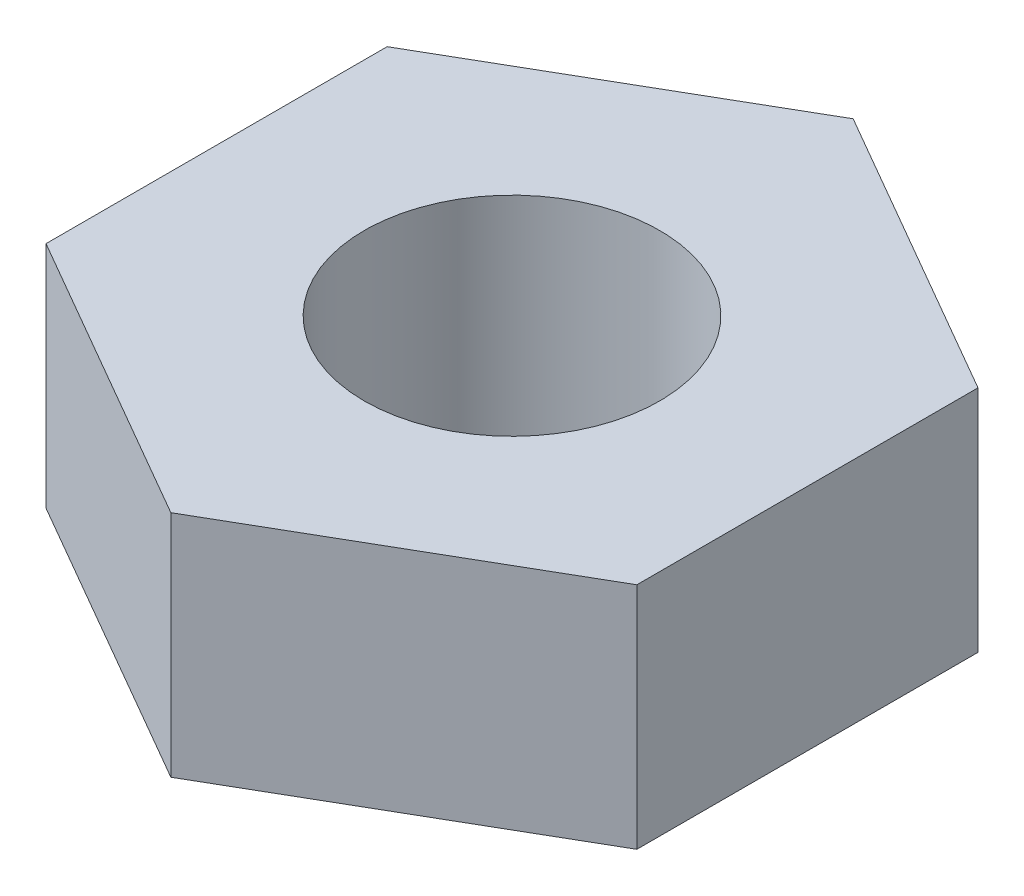
ISO-10303-21;
HEADER;
FILE_DESCRIPTION(('STEP AP214'),'2;1');
FILE_NAME('part.step','',(''),(''),'','','');
FILE_SCHEMA(('AUTOMOTIVE_DESIGN { 1 0 10303 214 1 1 1 1 }'));
ENDSEC;
DATA;
#1=APPLICATION_CONTEXT('core data for automotive mechanical design processes');
#2=APPLICATION_PROTOCOL_DEFINITION('international standard','automotive_design',2000,#1);
#3=PRODUCT_CONTEXT('',#1,'mechanical');
#4=PRODUCT('Part','Part','',(#3));
#5=PRODUCT_RELATED_PRODUCT_CATEGORY('part','',(#4));
#6=PRODUCT_DEFINITION_FORMATION('','',#4);
#7=PRODUCT_DEFINITION_CONTEXT('part definition',#1,'design');
#8=PRODUCT_DEFINITION('design','',#6,#7);
#9=PRODUCT_DEFINITION_SHAPE('','',#8);
#10=(LENGTH_UNIT() NAMED_UNIT(*) SI_UNIT(.MILLI.,.METRE.));
#11=(NAMED_UNIT(*) PLANE_ANGLE_UNIT() SI_UNIT($,.RADIAN.));
#12=(NAMED_UNIT(*) SI_UNIT($,.STERADIAN.) SOLID_ANGLE_UNIT());
#13=UNCERTAINTY_MEASURE_WITH_UNIT(LENGTH_MEASURE(1.E-05),#10,'distance_accuracy_value','');
#14=(GEOMETRIC_REPRESENTATION_CONTEXT(3) GLOBAL_UNCERTAINTY_ASSIGNED_CONTEXT((#13)) GLOBAL_UNIT_ASSIGNED_CONTEXT((#10,
#11,#12)) REPRESENTATION_CONTEXT('',''));
#15=CARTESIAN_POINT('',(0.,0.,0.));
#16=DIRECTION('',(0.,0.,1.));
#17=DIRECTION('',(1.,0.,0.));
#18=AXIS2_PLACEMENT_3D('',#15,#16,#17);
#19=CARTESIAN_POINT('',(0.,1.9,0.));
#20=DIRECTION('',(0.,1.,0.));
#21=DIRECTION('',(0.,0.,1.));
#22=AXIS2_PLACEMENT_3D('',#19,#20,#21);
#23=PLANE('',#22);
#24=DIRECTION('',(0.866025403784439,0.,0.5));
#25=VECTOR('',#24,1.);
#26=CARTESIAN_POINT('',(-2.45,1.9,1.41450815951458));
#27=LINE('',#26,#25);
#28=CARTESIAN_POINT('',(-2.45,1.9,1.41450815951458));
#29=VERTEX_POINT('',#28);
#30=CARTESIAN_POINT('',(0.,1.9,2.82901631902917));
#31=VERTEX_POINT('',#30);
#32=EDGE_CURVE('E129',#29,#31,#27,.T.);
#33=ORIENTED_EDGE('',*,*,#32,.T.);
#34=DIRECTION('',(0.866025403784439,0.,-0.5));
#35=VECTOR('',#34,1.);
#36=CARTESIAN_POINT('',(0.,1.9,2.82901631902917));
#37=LINE('',#36,#35);
#38=CARTESIAN_POINT('',(2.45,1.9,1.41450815951458));
#39=VERTEX_POINT('',#38);
#40=EDGE_CURVE('E87',#31,#39,#37,.T.);
#41=ORIENTED_EDGE('',*,*,#40,.T.);
#42=DIRECTION('',(0.,0.,-1.));
#43=VECTOR('',#42,1.);
#44=CARTESIAN_POINT('',(2.45,1.9,1.41450815951458));
#45=LINE('',#44,#43);
#46=CARTESIAN_POINT('',(2.45,1.9,-1.41450815951458));
#47=VERTEX_POINT('',#46);
#48=EDGE_CURVE('E100',#39,#47,#45,.T.);
#49=ORIENTED_EDGE('',*,*,#48,.T.);
#50=DIRECTION('',(-0.866025403784439,0.,-0.5));
#51=VECTOR('',#50,1.);
#52=CARTESIAN_POINT('',(2.45,1.9,-1.41450815951458));
#53=LINE('',#52,#51);
#54=CARTESIAN_POINT('',(0.,1.9,-2.82901631902917));
#55=VERTEX_POINT('',#54);
#56=EDGE_CURVE('E94',#47,#55,#53,.T.);
#57=ORIENTED_EDGE('',*,*,#56,.T.);
#58=DIRECTION('',(-0.866025403784439,0.,0.5));
#59=VECTOR('',#58,1.);
#60=CARTESIAN_POINT('',(0.,1.9,-2.82901631902917));
#61=LINE('',#60,#59);
#62=CARTESIAN_POINT('',(-2.45,1.9,-1.41450815951458));
#63=VERTEX_POINT('',#62);
#64=EDGE_CURVE('E98',#55,#63,#61,.T.);
#65=ORIENTED_EDGE('',*,*,#64,.T.);
#66=DIRECTION('',(0.,0.,1.));
#67=VECTOR('',#66,1.);
#68=CARTESIAN_POINT('',(-2.45,1.9,-1.41450815951458));
#69=LINE('',#68,#67);
#70=EDGE_CURVE('E50',#63,#29,#69,.T.);
#71=ORIENTED_EDGE('',*,*,#70,.T.);
#72=EDGE_LOOP('',(#33,#41,#49,#57,#65,#71));
#73=FACE_BOUND('',#72,.T.);
#74=CARTESIAN_POINT('',(0.,1.9,0.));
#75=DIRECTION('',(0.,1.,0.));
#76=DIRECTION('',(0.,0.,1.));
#77=AXIS2_PLACEMENT_3D('',#74,#75,#76);
#78=CIRCLE('',#77,1.225);
#79=CARTESIAN_POINT('',(0.,1.9,1.225));
#80=VERTEX_POINT('',#79);
#81=EDGE_CURVE('E122',#80,#80,#78,.T.);
#82=ORIENTED_EDGE('',*,*,#81,.F.);
#83=EDGE_LOOP('',(#82));
#84=FACE_BOUND('',#83,.T.);
#85=ADVANCED_FACE('F33',(#73,#84),#23,.T.);
#86=CARTESIAN_POINT('',(0.,0.,0.));
#87=DIRECTION('',(0.,1.,0.));
#88=DIRECTION('',(0.,0.,1.));
#89=AXIS2_PLACEMENT_3D('',#86,#87,#88);
#90=PLANE('',#89);
#91=DIRECTION('',(0.866025403784439,0.,0.5));
#92=VECTOR('',#91,1.);
#93=CARTESIAN_POINT('',(-2.45,0.,1.41450815951458));
#94=LINE('',#93,#92);
#95=CARTESIAN_POINT('',(-2.45,0.,1.41450815951458));
#96=VERTEX_POINT('',#95);
#97=CARTESIAN_POINT('',(0.,0.,2.82901631902917));
#98=VERTEX_POINT('',#97);
#99=EDGE_CURVE('E118',#96,#98,#94,.T.);
#100=ORIENTED_EDGE('',*,*,#99,.F.);
#101=DIRECTION('',(0.,0.,1.));
#102=VECTOR('',#101,1.);
#103=CARTESIAN_POINT('',(-2.45,0.,-1.41450815951458));
#104=LINE('',#103,#102);
#105=CARTESIAN_POINT('',(-2.45,0.,-1.41450815951458));
#106=VERTEX_POINT('',#105);
#107=EDGE_CURVE('E79',#106,#96,#104,.T.);
#108=ORIENTED_EDGE('',*,*,#107,.F.);
#109=DIRECTION('',(-0.866025403784439,0.,0.5));
#110=VECTOR('',#109,1.);
#111=CARTESIAN_POINT('',(0.,0.,-2.82901631902917));
#112=LINE('',#111,#110);
#113=CARTESIAN_POINT('',(0.,0.,-2.82901631902917));
#114=VERTEX_POINT('',#113);
#115=EDGE_CURVE('E73',#114,#106,#112,.T.);
#116=ORIENTED_EDGE('',*,*,#115,.F.);
#117=DIRECTION('',(-0.866025403784439,0.,-0.5));
#118=VECTOR('',#117,1.);
#119=CARTESIAN_POINT('',(2.45,0.,-1.41450815951458));
#120=LINE('',#119,#118);
#121=CARTESIAN_POINT('',(2.45,0.,-1.41450815951458));
#122=VERTEX_POINT('',#121);
#123=EDGE_CURVE('E108',#122,#114,#120,.T.);
#124=ORIENTED_EDGE('',*,*,#123,.F.);
#125=DIRECTION('',(0.,0.,-1.));
#126=VECTOR('',#125,1.);
#127=CARTESIAN_POINT('',(2.45,0.,1.41450815951458));
#128=LINE('',#127,#126);
#129=CARTESIAN_POINT('',(2.45,0.,1.41450815951458));
#130=VERTEX_POINT('',#129);
#131=EDGE_CURVE('E124',#130,#122,#128,.T.);
#132=ORIENTED_EDGE('',*,*,#131,.F.);
#133=DIRECTION('',(0.866025403784439,0.,-0.5));
#134=VECTOR('',#133,1.);
#135=CARTESIAN_POINT('',(0.,0.,2.82901631902917));
#136=LINE('',#135,#134);
#137=EDGE_CURVE('E121',#98,#130,#136,.T.);
#138=ORIENTED_EDGE('',*,*,#137,.F.);
#139=EDGE_LOOP('',(#100,#108,#116,#124,#132,#138));
#140=FACE_BOUND('',#139,.T.);
#141=CARTESIAN_POINT('',(0.,0.,0.));
#142=DIRECTION('',(0.,1.,0.));
#143=DIRECTION('',(0.,0.,1.));
#144=AXIS2_PLACEMENT_3D('',#141,#142,#143);
#145=CIRCLE('',#144,1.225);
#146=CARTESIAN_POINT('',(0.,0.,1.225));
#147=VERTEX_POINT('',#146);
#148=EDGE_CURVE('E222',#147,#147,#145,.T.);
#149=ORIENTED_EDGE('',*,*,#148,.T.);
#150=EDGE_LOOP('',(#149));
#151=FACE_BOUND('',#150,.T.);
#152=ADVANCED_FACE('F138',(#140,#151),#90,.F.);
#153=CARTESIAN_POINT('',(-2.45,1.9,1.41450815951458));
#154=DIRECTION('',(0.5,0.,-0.866025403784439));
#155=DIRECTION('',(-0.866025403784439,0.,-0.5));
#156=AXIS2_PLACEMENT_3D('',#153,#154,#155);
#157=PLANE('',#156);
#158=ORIENTED_EDGE('',*,*,#99,.T.);
#159=DIRECTION('',(0.,-1.,0.));
#160=VECTOR('',#159,1.);
#161=CARTESIAN_POINT('',(0.,1.9,2.82901631902917));
#162=LINE('',#161,#160);
#163=EDGE_CURVE('E11',#31,#98,#162,.T.);
#164=ORIENTED_EDGE('',*,*,#163,.F.);
#165=ORIENTED_EDGE('',*,*,#32,.F.);
#166=DIRECTION('',(0.,-1.,0.));
#167=VECTOR('',#166,1.);
#168=CARTESIAN_POINT('',(-2.45,1.9,1.41450815951458));
#169=LINE('',#168,#167);
#170=EDGE_CURVE('E114',#29,#96,#169,.T.);
#171=ORIENTED_EDGE('',*,*,#170,.T.);
#172=EDGE_LOOP('',(#158,#164,#165,#171));
#173=FACE_BOUND('',#172,.T.);
#174=ADVANCED_FACE('F35',(#173),#157,.F.);
#175=CARTESIAN_POINT('',(0.,1.9,2.82901631902917));
#176=DIRECTION('',(-0.5,0.,-0.866025403784439));
#177=DIRECTION('',(-0.866025403784439,0.,0.5));
#178=AXIS2_PLACEMENT_3D('',#175,#176,#177);
#179=PLANE('',#178);
#180=ORIENTED_EDGE('',*,*,#137,.T.);
#181=DIRECTION('',(0.,-1.,0.));
#182=VECTOR('',#181,1.);
#183=CARTESIAN_POINT('',(2.45,1.9,1.41450815951458));
#184=LINE('',#183,#182);
#185=EDGE_CURVE('E42',#39,#130,#184,.T.);
#186=ORIENTED_EDGE('',*,*,#185,.F.);
#187=ORIENTED_EDGE('',*,*,#40,.F.);
#188=ORIENTED_EDGE('',*,*,#163,.T.);
#189=EDGE_LOOP('',(#180,#186,#187,#188));
#190=FACE_BOUND('',#189,.T.);
#191=ADVANCED_FACE('F163',(#190),#179,.F.);
#192=CARTESIAN_POINT('',(2.45,1.9,1.41450815951458));
#193=DIRECTION('',(-1.,0.,0.));
#194=DIRECTION('',(0.,0.,1.));
#195=AXIS2_PLACEMENT_3D('',#192,#193,#194);
#196=PLANE('',#195);
#197=ORIENTED_EDGE('',*,*,#131,.T.);
#198=DIRECTION('',(0.,-1.,0.));
#199=VECTOR('',#198,1.);
#200=CARTESIAN_POINT('',(2.45,1.9,-1.41450815951458));
#201=LINE('',#200,#199);
#202=EDGE_CURVE('E109',#47,#122,#201,.T.);
#203=ORIENTED_EDGE('',*,*,#202,.F.);
#204=ORIENTED_EDGE('',*,*,#48,.F.);
#205=ORIENTED_EDGE('',*,*,#185,.T.);
#206=EDGE_LOOP('',(#197,#203,#204,#205));
#207=FACE_BOUND('',#206,.T.);
#208=ADVANCED_FACE('F135',(#207),#196,.F.);
#209=CARTESIAN_POINT('',(2.45,1.9,-1.41450815951458));
#210=DIRECTION('',(-0.5,0.,0.866025403784439));
#211=DIRECTION('',(0.866025403784439,0.,0.5));
#212=AXIS2_PLACEMENT_3D('',#209,#210,#211);
#213=PLANE('',#212);
#214=ORIENTED_EDGE('',*,*,#123,.T.);
#215=DIRECTION('',(0.,-1.,0.));
#216=VECTOR('',#215,1.);
#217=CARTESIAN_POINT('',(0.,1.9,-2.82901631902917));
#218=LINE('',#217,#216);
#219=EDGE_CURVE('E105',#55,#114,#218,.T.);
#220=ORIENTED_EDGE('',*,*,#219,.F.);
#221=ORIENTED_EDGE('',*,*,#56,.F.);
#222=ORIENTED_EDGE('',*,*,#202,.T.);
#223=EDGE_LOOP('',(#214,#220,#221,#222));
#224=FACE_BOUND('',#223,.T.);
#225=ADVANCED_FACE('F106',(#224),#213,.F.);
#226=CARTESIAN_POINT('',(0.,1.9,-2.82901631902917));
#227=DIRECTION('',(0.5,0.,0.866025403784439));
#228=DIRECTION('',(0.866025403784439,0.,-0.5));
#229=AXIS2_PLACEMENT_3D('',#226,#227,#228);
#230=PLANE('',#229);
#231=ORIENTED_EDGE('',*,*,#115,.T.);
#232=DIRECTION('',(0.,-1.,0.));
#233=VECTOR('',#232,1.);
#234=CARTESIAN_POINT('',(-2.45,1.9,-1.41450815951458));
#235=LINE('',#234,#233);
#236=EDGE_CURVE('E110',#63,#106,#235,.T.);
#237=ORIENTED_EDGE('',*,*,#236,.F.);
#238=ORIENTED_EDGE('',*,*,#64,.F.);
#239=ORIENTED_EDGE('',*,*,#219,.T.);
#240=EDGE_LOOP('',(#231,#237,#238,#239));
#241=FACE_BOUND('',#240,.T.);
#242=ADVANCED_FACE('F112',(#241),#230,.F.);
#243=CARTESIAN_POINT('',(-2.45,1.9,-1.41450815951458));
#244=DIRECTION('',(1.,0.,0.));
#245=DIRECTION('',(0.,0.,-1.));
#246=AXIS2_PLACEMENT_3D('',#243,#244,#245);
#247=PLANE('',#246);
#248=ORIENTED_EDGE('',*,*,#107,.T.);
#249=ORIENTED_EDGE('',*,*,#170,.F.);
#250=ORIENTED_EDGE('',*,*,#70,.F.);
#251=ORIENTED_EDGE('',*,*,#236,.T.);
#252=EDGE_LOOP('',(#248,#249,#250,#251));
#253=FACE_BOUND('',#252,.T.);
#254=ADVANCED_FACE('F143',(#253),#247,.F.);
#255=CARTESIAN_POINT('',(0.,1.9,0.));
#256=DIRECTION('',(0.,-1.,0.));
#257=DIRECTION('',(0.,0.,-1.));
#258=AXIS2_PLACEMENT_3D('',#255,#256,#257);
#259=CYLINDRICAL_SURFACE('',#258,1.225);
#260=ORIENTED_EDGE('',*,*,#81,.T.);
#261=EDGE_LOOP('',(#260));
#262=FACE_BOUND('',#261,.T.);
#263=ORIENTED_EDGE('',*,*,#148,.F.);
#264=EDGE_LOOP('',(#263));
#265=FACE_BOUND('',#264,.T.);
#266=ADVANCED_FACE('F145',(#262,#265),#259,.F.);
#267=CLOSED_SHELL('',(#85,#152,#174,#191,#208,#225,#242,#254,#266));
#268=MANIFOLD_SOLID_BREP('B2',#267);
#269=ADVANCED_BREP_SHAPE_REPRESENTATION('',(#18,#268),#14);
#270=SHAPE_DEFINITION_REPRESENTATION(#9,#269);
ENDSEC;
END-ISO-10303-21;
